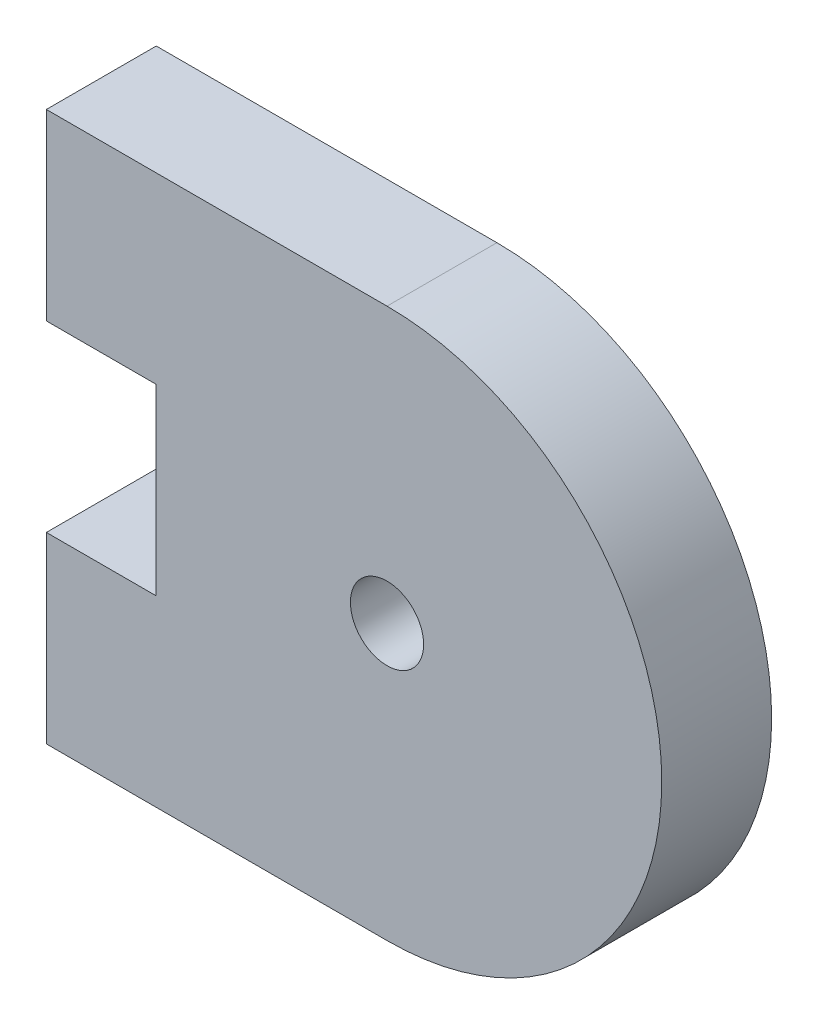
ISO-10303-21;
HEADER;
FILE_DESCRIPTION(('STEP AP214'),'2;1');
FILE_NAME('part.step','',(''),(''),'','','');
FILE_SCHEMA(('AUTOMOTIVE_DESIGN { 1 0 10303 214 1 1 1 1 }'));
ENDSEC;
DATA;
#1=APPLICATION_CONTEXT('core data for automotive mechanical design processes');
#2=APPLICATION_PROTOCOL_DEFINITION('international standard','automotive_design',2000,#1);
#3=PRODUCT_CONTEXT('',#1,'mechanical');
#4=PRODUCT('Part','Part','',(#3));
#5=PRODUCT_RELATED_PRODUCT_CATEGORY('part','',(#4));
#6=PRODUCT_DEFINITION_FORMATION('','',#4);
#7=PRODUCT_DEFINITION_CONTEXT('part definition',#1,'design');
#8=PRODUCT_DEFINITION('design','',#6,#7);
#9=PRODUCT_DEFINITION_SHAPE('','',#8);
#10=(LENGTH_UNIT() NAMED_UNIT(*) SI_UNIT(.MILLI.,.METRE.));
#11=(NAMED_UNIT(*) PLANE_ANGLE_UNIT() SI_UNIT($,.RADIAN.));
#12=(NAMED_UNIT(*) SI_UNIT($,.STERADIAN.) SOLID_ANGLE_UNIT());
#13=UNCERTAINTY_MEASURE_WITH_UNIT(LENGTH_MEASURE(1.E-05),#10,'distance_accuracy_value','');
#14=(GEOMETRIC_REPRESENTATION_CONTEXT(3) GLOBAL_UNCERTAINTY_ASSIGNED_CONTEXT((#13)) GLOBAL_UNIT_ASSIGNED_CONTEXT((#10,
#11,#12)) REPRESENTATION_CONTEXT('',''));
#15=CARTESIAN_POINT('',(0.,0.,0.));
#16=DIRECTION('',(0.,0.,1.));
#17=DIRECTION('',(1.,0.,0.));
#18=AXIS2_PLACEMENT_3D('',#15,#16,#17);
#19=CARTESIAN_POINT('',(42.3999999999994,42.378566682536,3.));
#20=DIRECTION('',(0.,0.,1.));
#21=DIRECTION('',(1.,0.,0.));
#22=AXIS2_PLACEMENT_3D('',#19,#20,#21);
#23=PLANE('',#22);
#24=CARTESIAN_POINT('',(42.3999999999994,42.378566682536,3.));
#25=DIRECTION('',(0.,0.,1.));
#26=DIRECTION('',(1.,0.,0.));
#27=AXIS2_PLACEMENT_3D('',#24,#25,#26);
#28=CIRCLE('',#27,7.50000000000006);
#29=CARTESIAN_POINT('',(42.3999999999994,34.8785666825359,3.));
#30=VERTEX_POINT('',#29);
#31=CARTESIAN_POINT('',(42.3999999999994,49.878566682536,3.));
#32=VERTEX_POINT('',#31);
#33=EDGE_CURVE('E145',#30,#32,#28,.T.);
#34=ORIENTED_EDGE('',*,*,#33,.T.);
#35=DIRECTION('',(-1.,0.,0.));
#36=VECTOR('',#35,1.);
#37=CARTESIAN_POINT('',(42.3999999999994,49.878566682536,3.));
#38=LINE('',#37,#36);
#39=CARTESIAN_POINT('',(33.1000000000014,49.878566682536,3.));
#40=VERTEX_POINT('',#39);
#41=EDGE_CURVE('E93',#32,#40,#38,.T.);
#42=ORIENTED_EDGE('',*,*,#41,.T.);
#43=DIRECTION('',(0.,-1.,0.));
#44=VECTOR('',#43,1.);
#45=CARTESIAN_POINT('',(33.1000000000014,49.878566682536,3.));
#46=LINE('',#45,#44);
#47=CARTESIAN_POINT('',(33.1000000000014,44.8785666825364,3.));
#48=VERTEX_POINT('',#47);
#49=EDGE_CURVE('E161',#40,#48,#46,.T.);
#50=ORIENTED_EDGE('',*,*,#49,.T.);
#51=DIRECTION('',(1.,0.,0.));
#52=VECTOR('',#51,1.);
#53=CARTESIAN_POINT('',(33.1000000000014,44.8785666825364,3.));
#54=LINE('',#53,#52);
#55=CARTESIAN_POINT('',(36.1000000000006,44.8785666825365,3.));
#56=VERTEX_POINT('',#55);
#57=EDGE_CURVE('E173',#48,#56,#54,.T.);
#58=ORIENTED_EDGE('',*,*,#57,.T.);
#59=DIRECTION('',(0.,-1.,0.));
#60=VECTOR('',#59,1.);
#61=CARTESIAN_POINT('',(36.1000000000006,44.8785666825365,3.));
#62=LINE('',#61,#60);
#63=CARTESIAN_POINT('',(36.1000000000006,39.878566682536,3.));
#64=VERTEX_POINT('',#63);
#65=EDGE_CURVE('E112',#56,#64,#62,.T.);
#66=ORIENTED_EDGE('',*,*,#65,.T.);
#67=DIRECTION('',(-1.,0.,0.));
#68=VECTOR('',#67,1.);
#69=CARTESIAN_POINT('',(36.1000000000006,39.878566682536,3.));
#70=LINE('',#69,#68);
#71=CARTESIAN_POINT('',(33.1000000000014,39.878566682536,3.));
#72=VERTEX_POINT('',#71);
#73=EDGE_CURVE('E106',#64,#72,#70,.T.);
#74=ORIENTED_EDGE('',*,*,#73,.T.);
#75=DIRECTION('',(0.,-1.,0.));
#76=VECTOR('',#75,1.);
#77=CARTESIAN_POINT('',(33.1000000000014,39.878566682536,3.));
#78=LINE('',#77,#76);
#79=CARTESIAN_POINT('',(33.1000000000014,34.8785666825359,3.));
#80=VERTEX_POINT('',#79);
#81=EDGE_CURVE('E110',#72,#80,#78,.T.);
#82=ORIENTED_EDGE('',*,*,#81,.T.);
#83=DIRECTION('',(1.,0.,0.));
#84=VECTOR('',#83,1.);
#85=CARTESIAN_POINT('',(33.1000000000014,34.8785666825359,3.));
#86=LINE('',#85,#84);
#87=EDGE_CURVE('E50',#80,#30,#86,.T.);
#88=ORIENTED_EDGE('',*,*,#87,.T.);
#89=EDGE_LOOP('',(#34,#42,#50,#58,#66,#74,#82,#88));
#90=FACE_BOUND('',#89,.T.);
#91=CARTESIAN_POINT('',(42.3999999999994,42.378566682536,3.));
#92=DIRECTION('',(0.,0.,1.));
#93=DIRECTION('',(1.,0.,0.));
#94=AXIS2_PLACEMENT_3D('',#91,#92,#93);
#95=CIRCLE('',#94,1.);
#96=CARTESIAN_POINT('',(43.3999999999994,42.378566682536,3.));
#97=VERTEX_POINT('',#96);
#98=EDGE_CURVE('E134',#97,#97,#95,.T.);
#99=ORIENTED_EDGE('',*,*,#98,.F.);
#100=EDGE_LOOP('',(#99));
#101=FACE_BOUND('',#100,.T.);
#102=ADVANCED_FACE('F32',(#90,#101),#23,.T.);
#103=CARTESIAN_POINT('',(42.3999999999994,42.378566682536,0.));
#104=DIRECTION('',(0.,0.,1.));
#105=DIRECTION('',(1.,0.,0.));
#106=AXIS2_PLACEMENT_3D('',#103,#104,#105);
#107=PLANE('',#106);
#108=CARTESIAN_POINT('',(42.3999999999994,42.378566682536,0.));
#109=DIRECTION('',(0.,0.,1.));
#110=DIRECTION('',(1.,0.,0.));
#111=AXIS2_PLACEMENT_3D('',#108,#109,#110);
#112=CIRCLE('',#111,2.14999999999999);
#113=CARTESIAN_POINT('',(44.5499999999993,42.378566682536,0.));
#114=VERTEX_POINT('',#113);
#115=EDGE_CURVE('E181',#114,#114,#112,.T.);
#116=ORIENTED_EDGE('',*,*,#115,.T.);
#117=EDGE_LOOP('',(#116));
#118=FACE_BOUND('',#117,.T.);
#119=CARTESIAN_POINT('',(42.3999999999994,42.378566682536,0.));
#120=DIRECTION('',(0.,0.,1.));
#121=DIRECTION('',(1.,0.,0.));
#122=AXIS2_PLACEMENT_3D('',#119,#120,#121);
#123=CIRCLE('',#122,7.50000000000006);
#124=CARTESIAN_POINT('',(42.3999999999994,34.8785666825359,0.));
#125=VERTEX_POINT('',#124);
#126=CARTESIAN_POINT('',(42.3999999999994,49.878566682536,0.));
#127=VERTEX_POINT('',#126);
#128=EDGE_CURVE('E130',#125,#127,#123,.T.);
#129=ORIENTED_EDGE('',*,*,#128,.F.);
#130=DIRECTION('',(1.,0.,0.));
#131=VECTOR('',#130,1.);
#132=CARTESIAN_POINT('',(33.1000000000014,34.8785666825359,0.));
#133=LINE('',#132,#131);
#134=CARTESIAN_POINT('',(33.1000000000014,34.8785666825359,0.));
#135=VERTEX_POINT('',#134);
#136=EDGE_CURVE('E85',#135,#125,#133,.T.);
#137=ORIENTED_EDGE('',*,*,#136,.F.);
#138=DIRECTION('',(0.,-1.,0.));
#139=VECTOR('',#138,1.);
#140=CARTESIAN_POINT('',(33.1000000000014,39.878566682536,0.));
#141=LINE('',#140,#139);
#142=CARTESIAN_POINT('',(33.1000000000014,39.878566682536,0.));
#143=VERTEX_POINT('',#142);
#144=EDGE_CURVE('E79',#143,#135,#141,.T.);
#145=ORIENTED_EDGE('',*,*,#144,.F.);
#146=DIRECTION('',(-1.,0.,0.));
#147=VECTOR('',#146,1.);
#148=CARTESIAN_POINT('',(36.1000000000006,39.878566682536,0.));
#149=LINE('',#148,#147);
#150=CARTESIAN_POINT('',(36.1000000000006,39.878566682536,0.));
#151=VERTEX_POINT('',#150);
#152=EDGE_CURVE('E120',#151,#143,#149,.T.);
#153=ORIENTED_EDGE('',*,*,#152,.F.);
#154=DIRECTION('',(0.,-1.,0.));
#155=VECTOR('',#154,1.);
#156=CARTESIAN_POINT('',(36.1000000000006,44.8785666825365,0.));
#157=LINE('',#156,#155);
#158=CARTESIAN_POINT('',(36.1000000000006,44.8785666825365,0.));
#159=VERTEX_POINT('',#158);
#160=EDGE_CURVE('E140',#159,#151,#157,.T.);
#161=ORIENTED_EDGE('',*,*,#160,.F.);
#162=DIRECTION('',(1.,0.,0.));
#163=VECTOR('',#162,1.);
#164=CARTESIAN_POINT('',(33.1000000000014,44.8785666825364,0.));
#165=LINE('',#164,#163);
#166=CARTESIAN_POINT('',(33.1000000000014,44.8785666825364,0.));
#167=VERTEX_POINT('',#166);
#168=EDGE_CURVE('E138',#167,#159,#165,.T.);
#169=ORIENTED_EDGE('',*,*,#168,.F.);
#170=DIRECTION('',(0.,-1.,0.));
#171=VECTOR('',#170,1.);
#172=CARTESIAN_POINT('',(33.1000000000014,49.878566682536,0.));
#173=LINE('',#172,#171);
#174=CARTESIAN_POINT('',(33.1000000000014,49.878566682536,0.));
#175=VERTEX_POINT('',#174);
#176=EDGE_CURVE('E136',#175,#167,#173,.T.);
#177=ORIENTED_EDGE('',*,*,#176,.F.);
#178=DIRECTION('',(-1.,0.,0.));
#179=VECTOR('',#178,1.);
#180=CARTESIAN_POINT('',(42.3999999999994,49.878566682536,0.));
#181=LINE('',#180,#179);
#182=EDGE_CURVE('E133',#127,#175,#181,.T.);
#183=ORIENTED_EDGE('',*,*,#182,.F.);
#184=EDGE_LOOP('',(#129,#137,#145,#153,#161,#169,#177,#183));
#185=FACE_BOUND('',#184,.T.);
#186=ADVANCED_FACE('F165',(#118,#185),#107,.F.);
#187=CARTESIAN_POINT('',(42.3999999999994,42.378566682536,3.));
#188=DIRECTION('',(0.,0.,-1.));
#189=DIRECTION('',(-1.,0.,0.));
#190=AXIS2_PLACEMENT_3D('',#187,#188,#189);
#191=CYLINDRICAL_SURFACE('',#190,7.50000000000006);
#192=ORIENTED_EDGE('',*,*,#128,.T.);
#193=DIRECTION('',(0.,0.,-1.));
#194=VECTOR('',#193,1.);
#195=CARTESIAN_POINT('',(42.3999999999994,49.878566682536,3.));
#196=LINE('',#195,#194);
#197=EDGE_CURVE('E11',#32,#127,#196,.T.);
#198=ORIENTED_EDGE('',*,*,#197,.F.);
#199=ORIENTED_EDGE('',*,*,#33,.F.);
#200=DIRECTION('',(0.,0.,-1.));
#201=VECTOR('',#200,1.);
#202=CARTESIAN_POINT('',(42.3999999999994,34.8785666825359,3.));
#203=LINE('',#202,#201);
#204=EDGE_CURVE('E126',#30,#125,#203,.T.);
#205=ORIENTED_EDGE('',*,*,#204,.T.);
#206=EDGE_LOOP('',(#192,#198,#199,#205));
#207=FACE_BOUND('',#206,.T.);
#208=ADVANCED_FACE('F34',(#207),#191,.T.);
#209=CARTESIAN_POINT('',(42.3999999999994,49.878566682536,3.));
#210=DIRECTION('',(0.,-1.,0.));
#211=DIRECTION('',(0.,0.,-1.));
#212=AXIS2_PLACEMENT_3D('',#209,#210,#211);
#213=PLANE('',#212);
#214=ORIENTED_EDGE('',*,*,#182,.T.);
#215=DIRECTION('',(0.,0.,-1.));
#216=VECTOR('',#215,1.);
#217=CARTESIAN_POINT('',(33.1000000000014,49.878566682536,3.));
#218=LINE('',#217,#216);
#219=EDGE_CURVE('E42',#40,#175,#218,.T.);
#220=ORIENTED_EDGE('',*,*,#219,.F.);
#221=ORIENTED_EDGE('',*,*,#41,.F.);
#222=ORIENTED_EDGE('',*,*,#197,.T.);
#223=EDGE_LOOP('',(#214,#220,#221,#222));
#224=FACE_BOUND('',#223,.T.);
#225=ADVANCED_FACE('F221',(#224),#213,.F.);
#226=CARTESIAN_POINT('',(33.1000000000014,49.878566682536,3.));
#227=DIRECTION('',(1.,0.,0.));
#228=DIRECTION('',(0.,0.,-1.));
#229=AXIS2_PLACEMENT_3D('',#226,#227,#228);
#230=PLANE('',#229);
#231=ORIENTED_EDGE('',*,*,#176,.T.);
#232=DIRECTION('',(0.,0.,-1.));
#233=VECTOR('',#232,1.);
#234=CARTESIAN_POINT('',(33.1000000000014,44.8785666825364,3.));
#235=LINE('',#234,#233);
#236=EDGE_CURVE('E152',#48,#167,#235,.T.);
#237=ORIENTED_EDGE('',*,*,#236,.F.);
#238=ORIENTED_EDGE('',*,*,#49,.F.);
#239=ORIENTED_EDGE('',*,*,#219,.T.);
#240=EDGE_LOOP('',(#231,#237,#238,#239));
#241=FACE_BOUND('',#240,.T.);
#242=ADVANCED_FACE('F159',(#241),#230,.F.);
#243=CARTESIAN_POINT('',(33.1000000000014,44.8785666825364,3.));
#244=DIRECTION('',(0.,1.,0.));
#245=DIRECTION('',(-1.,0.,0.));
#246=AXIS2_PLACEMENT_3D('',#243,#244,#245);
#247=PLANE('',#246);
#248=ORIENTED_EDGE('',*,*,#168,.T.);
#249=DIRECTION('',(0.,0.,-1.));
#250=VECTOR('',#249,1.);
#251=CARTESIAN_POINT('',(36.1000000000006,44.8785666825365,3.));
#252=LINE('',#251,#250);
#253=EDGE_CURVE('E149',#56,#159,#252,.T.);
#254=ORIENTED_EDGE('',*,*,#253,.F.);
#255=ORIENTED_EDGE('',*,*,#57,.F.);
#256=ORIENTED_EDGE('',*,*,#236,.T.);
#257=EDGE_LOOP('',(#248,#254,#255,#256));
#258=FACE_BOUND('',#257,.T.);
#259=ADVANCED_FACE('F169',(#258),#247,.F.);
#260=CARTESIAN_POINT('',(36.1000000000006,44.8785666825365,3.));
#261=DIRECTION('',(1.,0.,0.));
#262=DIRECTION('',(0.,0.,-1.));
#263=AXIS2_PLACEMENT_3D('',#260,#261,#262);
#264=PLANE('',#263);
#265=ORIENTED_EDGE('',*,*,#160,.T.);
#266=DIRECTION('',(0.,0.,-1.));
#267=VECTOR('',#266,1.);
#268=CARTESIAN_POINT('',(36.1000000000006,39.878566682536,3.));
#269=LINE('',#268,#267);
#270=EDGE_CURVE('E121',#64,#151,#269,.T.);
#271=ORIENTED_EDGE('',*,*,#270,.F.);
#272=ORIENTED_EDGE('',*,*,#65,.F.);
#273=ORIENTED_EDGE('',*,*,#253,.T.);
#274=EDGE_LOOP('',(#265,#271,#272,#273));
#275=FACE_BOUND('',#274,.T.);
#276=ADVANCED_FACE('F172',(#275),#264,.F.);
#277=CARTESIAN_POINT('',(36.1000000000006,39.878566682536,3.));
#278=DIRECTION('',(0.,-1.,0.));
#279=DIRECTION('',(0.,0.,-1.));
#280=AXIS2_PLACEMENT_3D('',#277,#278,#279);
#281=PLANE('',#280);
#282=ORIENTED_EDGE('',*,*,#152,.T.);
#283=DIRECTION('',(0.,0.,-1.));
#284=VECTOR('',#283,1.);
#285=CARTESIAN_POINT('',(33.1000000000014,39.878566682536,3.));
#286=LINE('',#285,#284);
#287=EDGE_CURVE('E117',#72,#143,#286,.T.);
#288=ORIENTED_EDGE('',*,*,#287,.F.);
#289=ORIENTED_EDGE('',*,*,#73,.F.);
#290=ORIENTED_EDGE('',*,*,#270,.T.);
#291=EDGE_LOOP('',(#282,#288,#289,#290));
#292=FACE_BOUND('',#291,.T.);
#293=ADVANCED_FACE('F118',(#292),#281,.F.);
#294=CARTESIAN_POINT('',(33.1000000000014,39.878566682536,3.));
#295=DIRECTION('',(1.,0.,0.));
#296=DIRECTION('',(0.,0.,-1.));
#297=AXIS2_PLACEMENT_3D('',#294,#295,#296);
#298=PLANE('',#297);
#299=ORIENTED_EDGE('',*,*,#144,.T.);
#300=DIRECTION('',(0.,0.,-1.));
#301=VECTOR('',#300,1.);
#302=CARTESIAN_POINT('',(33.1000000000014,34.8785666825359,3.));
#303=LINE('',#302,#301);
#304=EDGE_CURVE('E122',#80,#135,#303,.T.);
#305=ORIENTED_EDGE('',*,*,#304,.F.);
#306=ORIENTED_EDGE('',*,*,#81,.F.);
#307=ORIENTED_EDGE('',*,*,#287,.T.);
#308=EDGE_LOOP('',(#299,#305,#306,#307));
#309=FACE_BOUND('',#308,.T.);
#310=ADVANCED_FACE('F124',(#309),#298,.F.);
#311=CARTESIAN_POINT('',(33.1000000000014,34.8785666825359,3.));
#312=DIRECTION('',(0.,1.,0.));
#313=DIRECTION('',(0.,0.,1.));
#314=AXIS2_PLACEMENT_3D('',#311,#312,#313);
#315=PLANE('',#314);
#316=ORIENTED_EDGE('',*,*,#136,.T.);
#317=ORIENTED_EDGE('',*,*,#204,.F.);
#318=ORIENTED_EDGE('',*,*,#87,.F.);
#319=ORIENTED_EDGE('',*,*,#304,.T.);
#320=EDGE_LOOP('',(#316,#317,#318,#319));
#321=FACE_BOUND('',#320,.T.);
#322=ADVANCED_FACE('F198',(#321),#315,.F.);
#323=CARTESIAN_POINT('',(42.3999999999994,42.378566682536,3.));
#324=DIRECTION('',(0.,0.,-1.));
#325=DIRECTION('',(-1.,0.,0.));
#326=AXIS2_PLACEMENT_3D('',#323,#324,#325);
#327=CYLINDRICAL_SURFACE('',#326,1.);
#328=CARTESIAN_POINT('',(42.3999999999994,42.378566682536,1.));
#329=DIRECTION('',(0.,0.,1.));
#330=DIRECTION('',(1.,0.,0.));
#331=AXIS2_PLACEMENT_3D('',#328,#329,#330);
#332=CIRCLE('',#331,1.);
#333=CARTESIAN_POINT('',(43.3999999999994,42.378566682536,1.));
#334=VERTEX_POINT('',#333);
#335=EDGE_CURVE('E36',#334,#334,#332,.T.);
#336=ORIENTED_EDGE('',*,*,#335,.F.);
#337=EDGE_LOOP('',(#336));
#338=FACE_BOUND('',#337,.T.);
#339=ORIENTED_EDGE('',*,*,#98,.T.);
#340=EDGE_LOOP('',(#339));
#341=FACE_BOUND('',#340,.T.);
#342=ADVANCED_FACE('F194',(#338,#341),#327,.F.);
#343=CARTESIAN_POINT('',(42.3999999999994,42.378566682536,1.));
#344=DIRECTION('',(0.,0.,-1.));
#345=DIRECTION('',(-1.,0.,0.));
#346=AXIS2_PLACEMENT_3D('',#343,#344,#345);
#347=CYLINDRICAL_SURFACE('',#346,2.14999999999999);
#348=CARTESIAN_POINT('',(42.3999999999994,42.378566682536,1.));
#349=DIRECTION('',(0.,0.,1.));
#350=DIRECTION('',(1.,0.,0.));
#351=AXIS2_PLACEMENT_3D('',#348,#349,#350);
#352=CIRCLE('',#351,2.14999999999999);
#353=CARTESIAN_POINT('',(44.5499999999993,42.378566682536,1.));
#354=VERTEX_POINT('',#353);
#355=EDGE_CURVE('E184',#354,#354,#352,.T.);
#356=ORIENTED_EDGE('',*,*,#355,.T.);
#357=EDGE_LOOP('',(#356));
#358=FACE_BOUND('',#357,.T.);
#359=ORIENTED_EDGE('',*,*,#115,.F.);
#360=EDGE_LOOP('',(#359));
#361=FACE_BOUND('',#360,.T.);
#362=ADVANCED_FACE('F197',(#358,#361),#347,.F.);
#363=CARTESIAN_POINT('',(42.3999999999994,42.378566682536,1.));
#364=DIRECTION('',(0.,0.,1.));
#365=DIRECTION('',(1.,0.,0.));
#366=AXIS2_PLACEMENT_3D('',#363,#364,#365);
#367=PLANE('',#366);
#368=ORIENTED_EDGE('',*,*,#335,.T.);
#369=EDGE_LOOP('',(#368));
#370=FACE_BOUND('',#369,.T.);
#371=ORIENTED_EDGE('',*,*,#355,.F.);
#372=EDGE_LOOP('',(#371));
#373=FACE_BOUND('',#372,.T.);
#374=ADVANCED_FACE('F191',(#370,#373),#367,.F.);
#375=CLOSED_SHELL('',(#102,#186,#208,#225,#242,#259,#276,#293,#310,#322,#342,#362,#374));
#376=MANIFOLD_SOLID_BREP('B2',#375);
#377=ADVANCED_BREP_SHAPE_REPRESENTATION('',(#18,#376),#14);
#378=SHAPE_DEFINITION_REPRESENTATION(#9,#377);
ENDSEC;
END-ISO-10303-21;
